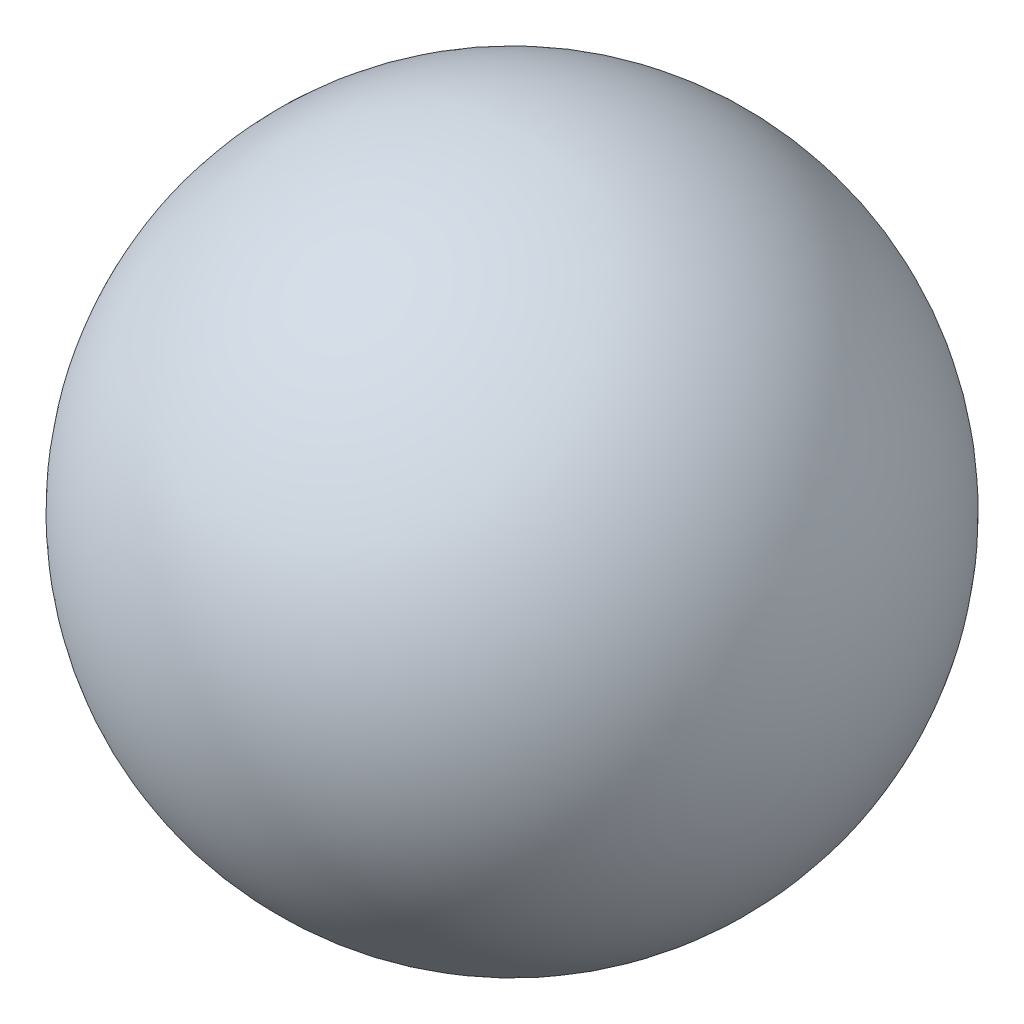
ISO-10303-21;
HEADER;
FILE_DESCRIPTION(('STEP AP214'),'2;1');
FILE_NAME('part.step','',(''),(''),'','','');
FILE_SCHEMA(('AUTOMOTIVE_DESIGN { 1 0 10303 214 1 1 1 1 }'));
ENDSEC;
DATA;
#1=APPLICATION_CONTEXT('core data for automotive mechanical design processes');
#2=APPLICATION_PROTOCOL_DEFINITION('international standard','automotive_design',2000,#1);
#3=PRODUCT_CONTEXT('',#1,'mechanical');
#4=PRODUCT('Part','Part','',(#3));
#5=PRODUCT_RELATED_PRODUCT_CATEGORY('part','',(#4));
#6=PRODUCT_DEFINITION_FORMATION('','',#4);
#7=PRODUCT_DEFINITION_CONTEXT('part definition',#1,'design');
#8=PRODUCT_DEFINITION('design','',#6,#7);
#9=PRODUCT_DEFINITION_SHAPE('','',#8);
#10=(LENGTH_UNIT() NAMED_UNIT(*) SI_UNIT(.MILLI.,.METRE.));
#11=(NAMED_UNIT(*) PLANE_ANGLE_UNIT() SI_UNIT($,.RADIAN.));
#12=(NAMED_UNIT(*) SI_UNIT($,.STERADIAN.) SOLID_ANGLE_UNIT());
#13=UNCERTAINTY_MEASURE_WITH_UNIT(LENGTH_MEASURE(1.E-05),#10,'distance_accuracy_value','');
#14=(GEOMETRIC_REPRESENTATION_CONTEXT(3) GLOBAL_UNCERTAINTY_ASSIGNED_CONTEXT((#13)) GLOBAL_UNIT_ASSIGNED_CONTEXT((#10,
#11,#12)) REPRESENTATION_CONTEXT('',''));
#15=CARTESIAN_POINT('',(0.,0.,0.));
#16=DIRECTION('',(0.,0.,1.));
#17=DIRECTION('',(1.,0.,0.));
#18=AXIS2_PLACEMENT_3D('',#15,#16,#17);
#19=CARTESIAN_POINT('',(-9.81371442752064,-3.1886691107064,0.));
#20=DIRECTION('',(1.,0.,0.));
#21=DIRECTION('',(0.,1.,0.));
#22=AXIS2_PLACEMENT_3D('',#19,#20,#21);
#23=SPHERICAL_SURFACE('',#22,1.71627890103155);
#24=CARTESIAN_POINT('',(-8.09743552648909,-3.1886691107064,0.));
#25=VERTEX_POINT('',#24);
#26=VERTEX_LOOP('',#25);
#27=FACE_BOUND('',#26,.T.);
#28=CARTESIAN_POINT('',(-11.5299933285522,-3.1886691107064,0.));
#29=VERTEX_POINT('',#28);
#30=VERTEX_LOOP('',#29);
#31=FACE_BOUND('',#30,.T.);
#32=ADVANCED_FACE('F16',(#27,#31),#23,.T.);
#33=CLOSED_SHELL('',(#32));
#34=MANIFOLD_SOLID_BREP('B1',#33);
#35=ADVANCED_BREP_SHAPE_REPRESENTATION('',(#18,#34),#14);
#36=SHAPE_DEFINITION_REPRESENTATION(#9,#35);
ENDSEC;
END-ISO-10303-21;
